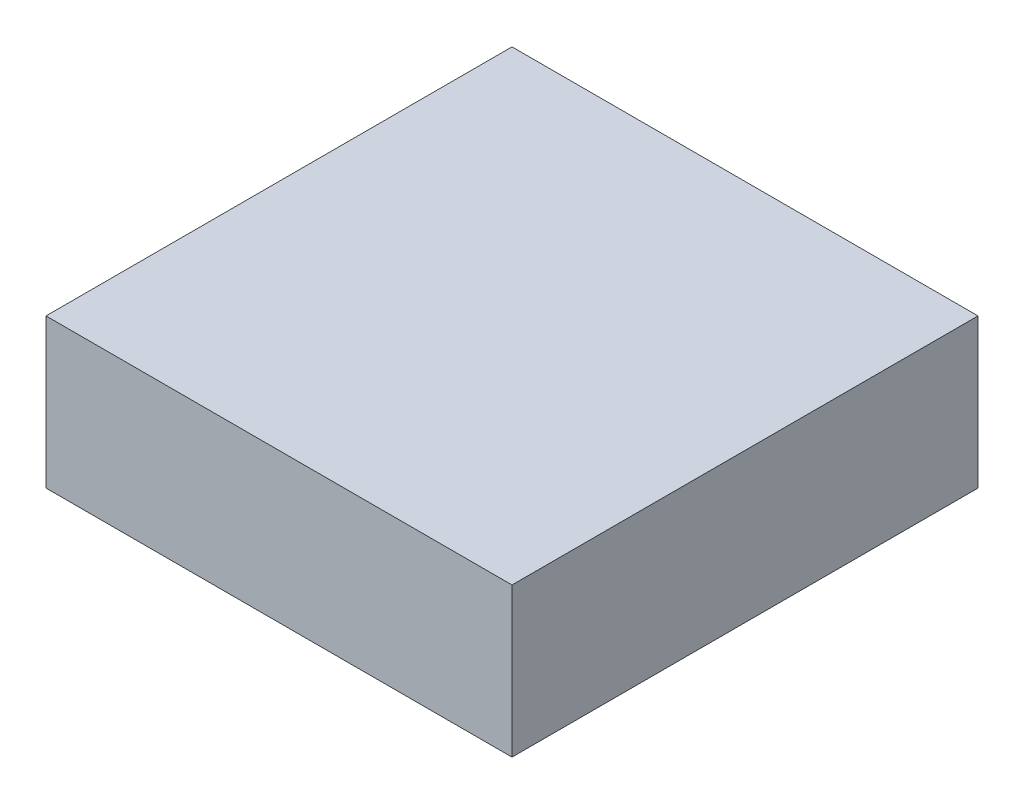
ISO-10303-21;
HEADER;
FILE_DESCRIPTION(('STEP AP214'),'2;1');
FILE_NAME('part.step','',(''),(''),'','','');
FILE_SCHEMA(('AUTOMOTIVE_DESIGN { 1 0 10303 214 1 1 1 1 }'));
ENDSEC;
DATA;
#1=APPLICATION_CONTEXT('core data for automotive mechanical design processes');
#2=APPLICATION_PROTOCOL_DEFINITION('international standard','automotive_design',2000,#1);
#3=PRODUCT_CONTEXT('',#1,'mechanical');
#4=PRODUCT('Part','Part','',(#3));
#5=PRODUCT_RELATED_PRODUCT_CATEGORY('part','',(#4));
#6=PRODUCT_DEFINITION_FORMATION('','',#4);
#7=PRODUCT_DEFINITION_CONTEXT('part definition',#1,'design');
#8=PRODUCT_DEFINITION('design','',#6,#7);
#9=PRODUCT_DEFINITION_SHAPE('','',#8);
#10=(LENGTH_UNIT() NAMED_UNIT(*) SI_UNIT(.MILLI.,.METRE.));
#11=(NAMED_UNIT(*) PLANE_ANGLE_UNIT() SI_UNIT($,.RADIAN.));
#12=(NAMED_UNIT(*) SI_UNIT($,.STERADIAN.) SOLID_ANGLE_UNIT());
#13=UNCERTAINTY_MEASURE_WITH_UNIT(LENGTH_MEASURE(1.E-05),#10,'distance_accuracy_value','');
#14=(GEOMETRIC_REPRESENTATION_CONTEXT(3) GLOBAL_UNCERTAINTY_ASSIGNED_CONTEXT((#13)) GLOBAL_UNIT_ASSIGNED_CONTEXT((#10,
#11,#12)) REPRESENTATION_CONTEXT('',''));
#15=CARTESIAN_POINT('',(0.,0.,0.));
#16=DIRECTION('',(0.,0.,1.));
#17=DIRECTION('',(1.,0.,0.));
#18=AXIS2_PLACEMENT_3D('',#15,#16,#17);
#19=CARTESIAN_POINT('',(1.25,0.8,-1.25));
#20=DIRECTION('',(-1.,0.,0.));
#21=DIRECTION('',(0.,0.,1.));
#22=AXIS2_PLACEMENT_3D('',#19,#20,#21);
#23=PLANE('',#22);
#24=DIRECTION('',(0.,0.,-1.));
#25=VECTOR('',#24,1.);
#26=CARTESIAN_POINT('',(1.25,0.,-1.25));
#27=LINE('',#26,#25);
#28=CARTESIAN_POINT('',(1.25,0.,1.25));
#29=VERTEX_POINT('',#28);
#30=CARTESIAN_POINT('',(1.25,0.,-1.25));
#31=VERTEX_POINT('',#30);
#32=EDGE_CURVE('E102',#29,#31,#27,.T.);
#33=ORIENTED_EDGE('',*,*,#32,.T.);
#34=DIRECTION('',(0.,-1.,0.));
#35=VECTOR('',#34,1.);
#36=CARTESIAN_POINT('',(1.25,0.8,-1.25));
#37=LINE('',#36,#35);
#38=CARTESIAN_POINT('',(1.25,0.8,-1.25));
#39=VERTEX_POINT('',#38);
#40=EDGE_CURVE('E11',#39,#31,#37,.T.);
#41=ORIENTED_EDGE('',*,*,#40,.F.);
#42=DIRECTION('',(0.,0.,-1.));
#43=VECTOR('',#42,1.);
#44=CARTESIAN_POINT('',(1.25,0.8,-1.25));
#45=LINE('',#44,#43);
#46=CARTESIAN_POINT('',(1.25,0.8,1.25));
#47=VERTEX_POINT('',#46);
#48=EDGE_CURVE('E90',#47,#39,#45,.T.);
#49=ORIENTED_EDGE('',*,*,#48,.F.);
#50=DIRECTION('',(0.,-1.,0.));
#51=VECTOR('',#50,1.);
#52=CARTESIAN_POINT('',(1.25,0.8,1.25));
#53=LINE('',#52,#51);
#54=EDGE_CURVE('E98',#47,#29,#53,.T.);
#55=ORIENTED_EDGE('',*,*,#54,.T.);
#56=EDGE_LOOP('',(#33,#41,#49,#55));
#57=FACE_BOUND('',#56,.T.);
#58=ADVANCED_FACE('F39',(#57),#23,.F.);
#59=CARTESIAN_POINT('',(-1.25,0.8,-1.25));
#60=DIRECTION('',(0.,0.,1.));
#61=DIRECTION('',(1.,0.,0.));
#62=AXIS2_PLACEMENT_3D('',#59,#60,#61);
#63=PLANE('',#62);
#64=DIRECTION('',(-1.,0.,0.));
#65=VECTOR('',#64,1.);
#66=CARTESIAN_POINT('',(-1.25,0.,-1.25));
#67=LINE('',#66,#65);
#68=CARTESIAN_POINT('',(-1.25,0.,-1.25));
#69=VERTEX_POINT('',#68);
#70=EDGE_CURVE('E94',#31,#69,#67,.T.);
#71=ORIENTED_EDGE('',*,*,#70,.T.);
#72=DIRECTION('',(0.,-1.,0.));
#73=VECTOR('',#72,1.);
#74=CARTESIAN_POINT('',(-1.25,0.8,-1.25));
#75=LINE('',#74,#73);
#76=CARTESIAN_POINT('',(-1.25,0.8,-1.25));
#77=VERTEX_POINT('',#76);
#78=EDGE_CURVE('E47',#77,#69,#75,.T.);
#79=ORIENTED_EDGE('',*,*,#78,.F.);
#80=DIRECTION('',(-1.,0.,0.));
#81=VECTOR('',#80,1.);
#82=CARTESIAN_POINT('',(-1.25,0.8,-1.25));
#83=LINE('',#82,#81);
#84=EDGE_CURVE('E85',#39,#77,#83,.T.);
#85=ORIENTED_EDGE('',*,*,#84,.F.);
#86=ORIENTED_EDGE('',*,*,#40,.T.);
#87=EDGE_LOOP('',(#71,#79,#85,#86));
#88=FACE_BOUND('',#87,.T.);
#89=ADVANCED_FACE('F93',(#88),#63,.F.);
#90=CARTESIAN_POINT('',(-1.25,0.8,-1.25));
#91=DIRECTION('',(1.,0.,0.));
#92=DIRECTION('',(0.,0.,-1.));
#93=AXIS2_PLACEMENT_3D('',#90,#91,#92);
#94=PLANE('',#93);
#95=DIRECTION('',(0.,0.,1.));
#96=VECTOR('',#95,1.);
#97=CARTESIAN_POINT('',(-1.25,0.,-1.25));
#98=LINE('',#97,#96);
#99=CARTESIAN_POINT('',(-1.25,0.,1.25));
#100=VERTEX_POINT('',#99);
#101=EDGE_CURVE('E72',#69,#100,#98,.T.);
#102=ORIENTED_EDGE('',*,*,#101,.T.);
#103=DIRECTION('',(0.,-1.,0.));
#104=VECTOR('',#103,1.);
#105=CARTESIAN_POINT('',(-1.25,0.8,1.25));
#106=LINE('',#105,#104);
#107=CARTESIAN_POINT('',(-1.25,0.8,1.25));
#108=VERTEX_POINT('',#107);
#109=EDGE_CURVE('E95',#108,#100,#106,.T.);
#110=ORIENTED_EDGE('',*,*,#109,.F.);
#111=DIRECTION('',(0.,0.,1.));
#112=VECTOR('',#111,1.);
#113=CARTESIAN_POINT('',(-1.25,0.8,-1.25));
#114=LINE('',#113,#112);
#115=EDGE_CURVE('E88',#77,#108,#114,.T.);
#116=ORIENTED_EDGE('',*,*,#115,.F.);
#117=ORIENTED_EDGE('',*,*,#78,.T.);
#118=EDGE_LOOP('',(#102,#110,#116,#117));
#119=FACE_BOUND('',#118,.T.);
#120=ADVANCED_FACE('F96',(#119),#94,.F.);
#121=CARTESIAN_POINT('',(-1.25,0.8,1.25));
#122=DIRECTION('',(0.,0.,-1.));
#123=DIRECTION('',(-1.,0.,0.));
#124=AXIS2_PLACEMENT_3D('',#121,#122,#123);
#125=PLANE('',#124);
#126=DIRECTION('',(1.,0.,0.));
#127=VECTOR('',#126,1.);
#128=CARTESIAN_POINT('',(-1.25,0.,1.25));
#129=LINE('',#128,#127);
#130=EDGE_CURVE('E78',#100,#29,#129,.T.);
#131=ORIENTED_EDGE('',*,*,#130,.T.);
#132=ORIENTED_EDGE('',*,*,#54,.F.);
#133=DIRECTION('',(1.,0.,0.));
#134=VECTOR('',#133,1.);
#135=CARTESIAN_POINT('',(-1.25,0.8,1.25));
#136=LINE('',#135,#134);
#137=EDGE_CURVE('E55',#108,#47,#136,.T.);
#138=ORIENTED_EDGE('',*,*,#137,.F.);
#139=ORIENTED_EDGE('',*,*,#109,.T.);
#140=EDGE_LOOP('',(#131,#132,#138,#139));
#141=FACE_BOUND('',#140,.T.);
#142=ADVANCED_FACE('F109',(#141),#125,.F.);
#143=CARTESIAN_POINT('',(0.,0.8,0.));
#144=DIRECTION('',(0.,1.,0.));
#145=DIRECTION('',(0.,0.,1.));
#146=AXIS2_PLACEMENT_3D('',#143,#144,#145);
#147=PLANE('',#146);
#148=ORIENTED_EDGE('',*,*,#48,.T.);
#149=ORIENTED_EDGE('',*,*,#84,.T.);
#150=ORIENTED_EDGE('',*,*,#115,.T.);
#151=ORIENTED_EDGE('',*,*,#137,.T.);
#152=EDGE_LOOP('',(#148,#149,#150,#151));
#153=FACE_BOUND('',#152,.T.);
#154=ADVANCED_FACE('F86',(#153),#147,.T.);
#155=CARTESIAN_POINT('',(0.,0.,0.));
#156=DIRECTION('',(0.,1.,0.));
#157=DIRECTION('',(0.,0.,1.));
#158=AXIS2_PLACEMENT_3D('',#155,#156,#157);
#159=PLANE('',#158);
#160=ORIENTED_EDGE('',*,*,#32,.F.);
#161=ORIENTED_EDGE('',*,*,#130,.F.);
#162=ORIENTED_EDGE('',*,*,#101,.F.);
#163=ORIENTED_EDGE('',*,*,#70,.F.);
#164=EDGE_LOOP('',(#160,#161,#162,#163));
#165=FACE_BOUND('',#164,.T.);
#166=ADVANCED_FACE('F112',(#165),#159,.F.);
#167=CLOSED_SHELL('',(#58,#89,#120,#142,#154,#166));
#168=MANIFOLD_SOLID_BREP('B2',#167);
#169=ADVANCED_BREP_SHAPE_REPRESENTATION('',(#18,#168),#14);
#170=SHAPE_DEFINITION_REPRESENTATION(#9,#169);
ENDSEC;
END-ISO-10303-21;
